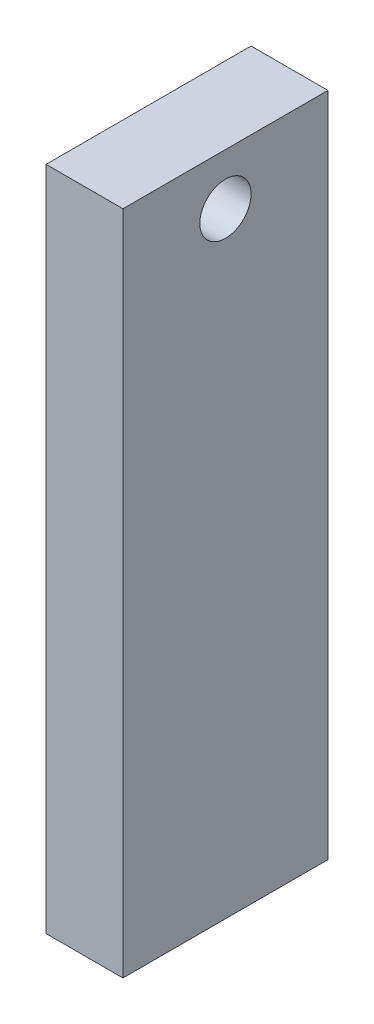
ISO-10303-21;
HEADER;
FILE_DESCRIPTION(('STEP AP214'),'2;1');
FILE_NAME('part.step','',(''),(''),'','','');
FILE_SCHEMA(('AUTOMOTIVE_DESIGN { 1 0 10303 214 1 1 1 1 }'));
ENDSEC;
DATA;
#1=APPLICATION_CONTEXT('core data for automotive mechanical design processes');
#2=APPLICATION_PROTOCOL_DEFINITION('international standard','automotive_design',2000,#1);
#3=PRODUCT_CONTEXT('',#1,'mechanical');
#4=PRODUCT('Part','Part','',(#3));
#5=PRODUCT_RELATED_PRODUCT_CATEGORY('part','',(#4));
#6=PRODUCT_DEFINITION_FORMATION('','',#4);
#7=PRODUCT_DEFINITION_CONTEXT('part definition',#1,'design');
#8=PRODUCT_DEFINITION('design','',#6,#7);
#9=PRODUCT_DEFINITION_SHAPE('','',#8);
#10=(LENGTH_UNIT() NAMED_UNIT(*) SI_UNIT(.MILLI.,.METRE.));
#11=(NAMED_UNIT(*) PLANE_ANGLE_UNIT() SI_UNIT($,.RADIAN.));
#12=(NAMED_UNIT(*) SI_UNIT($,.STERADIAN.) SOLID_ANGLE_UNIT());
#13=UNCERTAINTY_MEASURE_WITH_UNIT(LENGTH_MEASURE(1.E-05),#10,'distance_accuracy_value','');
#14=(GEOMETRIC_REPRESENTATION_CONTEXT(3) GLOBAL_UNCERTAINTY_ASSIGNED_CONTEXT((#13)) GLOBAL_UNIT_ASSIGNED_CONTEXT((#10,
#11,#12)) REPRESENTATION_CONTEXT('',''));
#15=CARTESIAN_POINT('',(0.,0.,0.));
#16=DIRECTION('',(0.,0.,1.));
#17=DIRECTION('',(1.,0.,0.));
#18=AXIS2_PLACEMENT_3D('',#15,#16,#17);
#19=CARTESIAN_POINT('',(19.05,0.,0.));
#20=DIRECTION('',(-1.,0.,0.));
#21=DIRECTION('',(0.,0.,1.));
#22=AXIS2_PLACEMENT_3D('',#19,#20,#21);
#23=PLANE('',#22);
#24=DIRECTION('',(0.,-1.,0.));
#25=VECTOR('',#24,1.);
#26=CARTESIAN_POINT('',(19.05,0.,0.));
#27=LINE('',#26,#25);
#28=CARTESIAN_POINT('',(19.05,165.1,0.));
#29=VERTEX_POINT('',#28);
#30=CARTESIAN_POINT('',(19.05,0.,0.));
#31=VERTEX_POINT('',#30);
#32=EDGE_CURVE('E85',#29,#31,#27,.T.);
#33=ORIENTED_EDGE('',*,*,#32,.T.);
#34=DIRECTION('',(0.,0.,-1.));
#35=VECTOR('',#34,1.);
#36=CARTESIAN_POINT('',(19.05,0.,0.));
#37=LINE('',#36,#35);
#38=CARTESIAN_POINT('',(19.05,0.,-50.8));
#39=VERTEX_POINT('',#38);
#40=EDGE_CURVE('E80',#31,#39,#37,.T.);
#41=ORIENTED_EDGE('',*,*,#40,.T.);
#42=DIRECTION('',(0.,1.,0.));
#43=VECTOR('',#42,1.);
#44=CARTESIAN_POINT('',(19.05,0.,-50.8));
#45=LINE('',#44,#43);
#46=CARTESIAN_POINT('',(19.05,165.1,-50.8));
#47=VERTEX_POINT('',#46);
#48=EDGE_CURVE('E83',#39,#47,#45,.T.);
#49=ORIENTED_EDGE('',*,*,#48,.T.);
#50=DIRECTION('',(0.,0.,1.));
#51=VECTOR('',#50,1.);
#52=CARTESIAN_POINT('',(19.05,165.1,0.));
#53=LINE('',#52,#51);
#54=EDGE_CURVE('E50',#47,#29,#53,.T.);
#55=ORIENTED_EDGE('',*,*,#54,.T.);
#56=EDGE_LOOP('',(#33,#41,#49,#55));
#57=FACE_BOUND('',#56,.T.);
#58=CARTESIAN_POINT('',(19.05,152.4,-25.4));
#59=DIRECTION('',(1.,0.,0.));
#60=DIRECTION('',(0.,0.,-1.));
#61=AXIS2_PLACEMENT_3D('',#58,#59,#60);
#62=CIRCLE('',#61,6.35);
#63=CARTESIAN_POINT('',(19.05,152.4,-31.75));
#64=VERTEX_POINT('',#63);
#65=EDGE_CURVE('E100',#64,#64,#62,.T.);
#66=ORIENTED_EDGE('',*,*,#65,.F.);
#67=EDGE_LOOP('',(#66));
#68=FACE_BOUND('',#67,.T.);
#69=ADVANCED_FACE('F33',(#57,#68),#23,.F.);
#70=CARTESIAN_POINT('',(0.,0.,0.));
#71=DIRECTION('',(-1.,0.,0.));
#72=DIRECTION('',(0.,0.,1.));
#73=AXIS2_PLACEMENT_3D('',#70,#71,#72);
#74=PLANE('',#73);
#75=DIRECTION('',(0.,-1.,0.));
#76=VECTOR('',#75,1.);
#77=CARTESIAN_POINT('',(0.,0.,0.));
#78=LINE('',#77,#76);
#79=CARTESIAN_POINT('',(0.,165.1,0.));
#80=VERTEX_POINT('',#79);
#81=CARTESIAN_POINT('',(0.,0.,0.));
#82=VERTEX_POINT('',#81);
#83=EDGE_CURVE('E97',#80,#82,#78,.T.);
#84=ORIENTED_EDGE('',*,*,#83,.F.);
#85=DIRECTION('',(0.,0.,1.));
#86=VECTOR('',#85,1.);
#87=CARTESIAN_POINT('',(0.,165.1,0.));
#88=LINE('',#87,#86);
#89=CARTESIAN_POINT('',(0.,165.1,-50.8));
#90=VERTEX_POINT('',#89);
#91=EDGE_CURVE('E73',#90,#80,#88,.T.);
#92=ORIENTED_EDGE('',*,*,#91,.F.);
#93=DIRECTION('',(0.,1.,0.));
#94=VECTOR('',#93,1.);
#95=CARTESIAN_POINT('',(0.,0.,-50.8));
#96=LINE('',#95,#94);
#97=CARTESIAN_POINT('',(0.,0.,-50.8));
#98=VERTEX_POINT('',#97);
#99=EDGE_CURVE('E67',#98,#90,#96,.T.);
#100=ORIENTED_EDGE('',*,*,#99,.F.);
#101=DIRECTION('',(0.,0.,-1.));
#102=VECTOR('',#101,1.);
#103=CARTESIAN_POINT('',(0.,0.,0.));
#104=LINE('',#103,#102);
#105=EDGE_CURVE('E89',#82,#98,#104,.T.);
#106=ORIENTED_EDGE('',*,*,#105,.F.);
#107=EDGE_LOOP('',(#84,#92,#100,#106));
#108=FACE_BOUND('',#107,.T.);
#109=CARTESIAN_POINT('',(0.,152.4,-25.4));
#110=DIRECTION('',(1.,0.,0.));
#111=DIRECTION('',(0.,0.,-1.));
#112=AXIS2_PLACEMENT_3D('',#109,#110,#111);
#113=CIRCLE('',#112,6.35);
#114=CARTESIAN_POINT('',(0.,152.4,-31.75));
#115=VERTEX_POINT('',#114);
#116=EDGE_CURVE('E112',#115,#115,#113,.T.);
#117=ORIENTED_EDGE('',*,*,#116,.T.);
#118=EDGE_LOOP('',(#117));
#119=FACE_BOUND('',#118,.T.);
#120=ADVANCED_FACE('F108',(#108,#119),#74,.T.);
#121=CARTESIAN_POINT('',(19.05,0.,0.));
#122=DIRECTION('',(0.,0.,-1.));
#123=DIRECTION('',(-1.,0.,0.));
#124=AXIS2_PLACEMENT_3D('',#121,#122,#123);
#125=PLANE('',#124);
#126=ORIENTED_EDGE('',*,*,#83,.T.);
#127=DIRECTION('',(-1.,0.,0.));
#128=VECTOR('',#127,1.);
#129=CARTESIAN_POINT('',(19.05,0.,0.));
#130=LINE('',#129,#128);
#131=EDGE_CURVE('E11',#31,#82,#130,.T.);
#132=ORIENTED_EDGE('',*,*,#131,.F.);
#133=ORIENTED_EDGE('',*,*,#32,.F.);
#134=DIRECTION('',(-1.,0.,0.));
#135=VECTOR('',#134,1.);
#136=CARTESIAN_POINT('',(19.05,165.1,0.));
#137=LINE('',#136,#135);
#138=EDGE_CURVE('E93',#29,#80,#137,.T.);
#139=ORIENTED_EDGE('',*,*,#138,.T.);
#140=EDGE_LOOP('',(#126,#132,#133,#139));
#141=FACE_BOUND('',#140,.T.);
#142=ADVANCED_FACE('F35',(#141),#125,.F.);
#143=CARTESIAN_POINT('',(19.05,0.,0.));
#144=DIRECTION('',(0.,1.,0.));
#145=DIRECTION('',(0.,0.,1.));
#146=AXIS2_PLACEMENT_3D('',#143,#144,#145);
#147=PLANE('',#146);
#148=ORIENTED_EDGE('',*,*,#105,.T.);
#149=DIRECTION('',(-1.,0.,0.));
#150=VECTOR('',#149,1.);
#151=CARTESIAN_POINT('',(19.05,0.,-50.8));
#152=LINE('',#151,#150);
#153=EDGE_CURVE('E42',#39,#98,#152,.T.);
#154=ORIENTED_EDGE('',*,*,#153,.F.);
#155=ORIENTED_EDGE('',*,*,#40,.F.);
#156=ORIENTED_EDGE('',*,*,#131,.T.);
#157=EDGE_LOOP('',(#148,#154,#155,#156));
#158=FACE_BOUND('',#157,.T.);
#159=ADVANCED_FACE('F88',(#158),#147,.F.);
#160=CARTESIAN_POINT('',(19.05,0.,-50.8));
#161=DIRECTION('',(0.,0.,1.));
#162=DIRECTION('',(1.,0.,0.));
#163=AXIS2_PLACEMENT_3D('',#160,#161,#162);
#164=PLANE('',#163);
#165=ORIENTED_EDGE('',*,*,#99,.T.);
#166=DIRECTION('',(-1.,0.,0.));
#167=VECTOR('',#166,1.);
#168=CARTESIAN_POINT('',(19.05,165.1,-50.8));
#169=LINE('',#168,#167);
#170=EDGE_CURVE('E90',#47,#90,#169,.T.);
#171=ORIENTED_EDGE('',*,*,#170,.F.);
#172=ORIENTED_EDGE('',*,*,#48,.F.);
#173=ORIENTED_EDGE('',*,*,#153,.T.);
#174=EDGE_LOOP('',(#165,#171,#172,#173));
#175=FACE_BOUND('',#174,.T.);
#176=ADVANCED_FACE('F91',(#175),#164,.F.);
#177=CARTESIAN_POINT('',(19.05,165.1,0.));
#178=DIRECTION('',(0.,-1.,0.));
#179=DIRECTION('',(0.,0.,-1.));
#180=AXIS2_PLACEMENT_3D('',#177,#178,#179);
#181=PLANE('',#180);
#182=ORIENTED_EDGE('',*,*,#91,.T.);
#183=ORIENTED_EDGE('',*,*,#138,.F.);
#184=ORIENTED_EDGE('',*,*,#54,.F.);
#185=ORIENTED_EDGE('',*,*,#170,.T.);
#186=EDGE_LOOP('',(#182,#183,#184,#185));
#187=FACE_BOUND('',#186,.T.);
#188=ADVANCED_FACE('F105',(#187),#181,.F.);
#189=CARTESIAN_POINT('',(19.05,152.4,-25.4));
#190=DIRECTION('',(-1.,0.,0.));
#191=DIRECTION('',(0.,0.,1.));
#192=AXIS2_PLACEMENT_3D('',#189,#190,#191);
#193=CYLINDRICAL_SURFACE('',#192,6.35);
#194=ORIENTED_EDGE('',*,*,#65,.T.);
#195=EDGE_LOOP('',(#194));
#196=FACE_BOUND('',#195,.T.);
#197=ORIENTED_EDGE('',*,*,#116,.F.);
#198=EDGE_LOOP('',(#197));
#199=FACE_BOUND('',#198,.T.);
#200=ADVANCED_FACE('F118',(#196,#199),#193,.F.);
#201=CLOSED_SHELL('',(#69,#120,#142,#159,#176,#188,#200));
#202=MANIFOLD_SOLID_BREP('B2',#201);
#203=ADVANCED_BREP_SHAPE_REPRESENTATION('',(#18,#202),#14);
#204=SHAPE_DEFINITION_REPRESENTATION(#9,#203);
ENDSEC;
END-ISO-10303-21;
